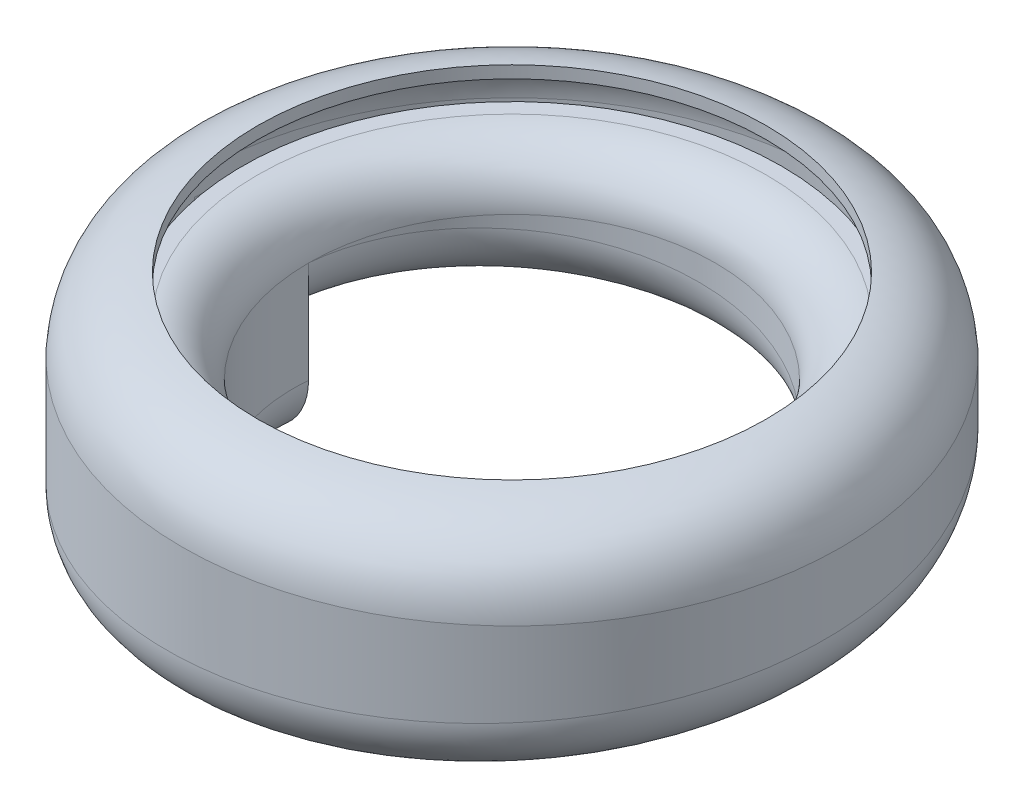
ISO-10303-21;
HEADER;
FILE_DESCRIPTION(('STEP AP214'),'2;1');
FILE_NAME('part.step','',(''),(''),'','','');
FILE_SCHEMA(('AUTOMOTIVE_DESIGN { 1 0 10303 214 1 1 1 1 }'));
ENDSEC;
DATA;
#1=APPLICATION_CONTEXT('core data for automotive mechanical design processes');
#2=APPLICATION_PROTOCOL_DEFINITION('international standard','automotive_design',2000,#1);
#3=PRODUCT_CONTEXT('',#1,'mechanical');
#4=PRODUCT('Part','Part','',(#3));
#5=PRODUCT_RELATED_PRODUCT_CATEGORY('part','',(#4));
#6=PRODUCT_DEFINITION_FORMATION('','',#4);
#7=PRODUCT_DEFINITION_CONTEXT('part definition',#1,'design');
#8=PRODUCT_DEFINITION('design','',#6,#7);
#9=PRODUCT_DEFINITION_SHAPE('','',#8);
#10=(LENGTH_UNIT() NAMED_UNIT(*) SI_UNIT(.MILLI.,.METRE.));
#11=(NAMED_UNIT(*) PLANE_ANGLE_UNIT() SI_UNIT($,.RADIAN.));
#12=(NAMED_UNIT(*) SI_UNIT($,.STERADIAN.) SOLID_ANGLE_UNIT());
#13=UNCERTAINTY_MEASURE_WITH_UNIT(LENGTH_MEASURE(1.E-05),#10,'distance_accuracy_value','');
#14=(GEOMETRIC_REPRESENTATION_CONTEXT(3) GLOBAL_UNCERTAINTY_ASSIGNED_CONTEXT((#13)) GLOBAL_UNIT_ASSIGNED_CONTEXT((#10,
#11,#12)) REPRESENTATION_CONTEXT('',''));
#15=CARTESIAN_POINT('',(0.,0.,0.));
#16=DIRECTION('',(0.,0.,1.));
#17=DIRECTION('',(1.,0.,0.));
#18=AXIS2_PLACEMENT_3D('',#15,#16,#17);
#19=CARTESIAN_POINT('',(0.,0.,0.));
#20=DIRECTION('',(0.,-1.,0.));
#21=DIRECTION('',(0.,0.,-1.));
#22=AXIS2_PLACEMENT_3D('',#19,#20,#21);
#23=TOROIDAL_SURFACE('',#22,25.,3.80000000000001);
#24=CARTESIAN_POINT('',(0.,3.8,0.));
#25=DIRECTION('',(0.,-1.,0.));
#26=DIRECTION('',(0.,0.,-1.));
#27=AXIS2_PLACEMENT_3D('',#24,#25,#26);
#28=CIRCLE('',#27,25.);
#29=CARTESIAN_POINT('',(0.,3.8,-25.));
#30=VERTEX_POINT('',#29);
#31=EDGE_CURVE('E127',#30,#30,#28,.T.);
#32=ORIENTED_EDGE('',*,*,#31,.T.);
#33=EDGE_LOOP('',(#32));
#34=FACE_BOUND('',#33,.T.);
#35=CARTESIAN_POINT('',(0.,0.,0.));
#36=DIRECTION('',(0.,-1.,0.));
#37=DIRECTION('',(0.,0.,-1.));
#38=AXIS2_PLACEMENT_3D('',#35,#36,#37);
#39=CIRCLE('',#38,21.2);
#40=CARTESIAN_POINT('',(-21.2,0.,0.));
#41=VERTEX_POINT('',#40);
#42=EDGE_CURVE('E233',#41,#41,#39,.T.);
#43=ORIENTED_EDGE('',*,*,#42,.F.);
#44=EDGE_LOOP('',(#43));
#45=FACE_BOUND('',#44,.T.);
#46=ADVANCED_FACE('F173',(#34,#45),#23,.F.);
#47=CARTESIAN_POINT('',(25.,3.8,0.));
#48=DIRECTION('',(0.,-1.,0.));
#49=DIRECTION('',(0.,0.,-1.));
#50=AXIS2_PLACEMENT_3D('',#47,#48,#49);
#51=PLANE('',#50);
#52=CARTESIAN_POINT('',(0.,3.8,0.));
#53=DIRECTION('',(0.,-1.,0.));
#54=DIRECTION('',(0.,0.,-1.));
#55=AXIS2_PLACEMENT_3D('',#52,#53,#54);
#56=CIRCLE('',#55,26.5);
#57=CARTESIAN_POINT('',(0.,3.80000000000001,-26.5));
#58=VERTEX_POINT('',#57);
#59=EDGE_CURVE('E181',#58,#58,#56,.T.);
#60=ORIENTED_EDGE('',*,*,#59,.T.);
#61=EDGE_LOOP('',(#60));
#62=FACE_BOUND('',#61,.T.);
#63=ORIENTED_EDGE('',*,*,#31,.F.);
#64=EDGE_LOOP('',(#63));
#65=FACE_BOUND('',#64,.T.);
#66=ADVANCED_FACE('F267',(#62,#65),#51,.T.);
#67=CARTESIAN_POINT('',(0.,-9.99999999999999,0.));
#68=DIRECTION('',(0.,-1.,0.));
#69=DIRECTION('',(0.,0.,-1.));
#70=AXIS2_PLACEMENT_3D('',#67,#68,#69);
#71=CYLINDRICAL_SURFACE('',#70,26.5);
#72=CARTESIAN_POINT('',(0.,5.,0.));
#73=DIRECTION('',(0.,-1.,0.));
#74=DIRECTION('',(0.,0.,-1.));
#75=AXIS2_PLACEMENT_3D('',#72,#73,#74);
#76=CIRCLE('',#75,26.5);
#77=CARTESIAN_POINT('',(0.,5.00000000000001,-26.5));
#78=VERTEX_POINT('',#77);
#79=EDGE_CURVE('E262',#78,#78,#76,.T.);
#80=ORIENTED_EDGE('',*,*,#79,.T.);
#81=EDGE_LOOP('',(#80));
#82=FACE_BOUND('',#81,.T.);
#83=ORIENTED_EDGE('',*,*,#59,.F.);
#84=EDGE_LOOP('',(#83));
#85=FACE_BOUND('',#84,.T.);
#86=ADVANCED_FACE('F270',(#82,#85),#71,.T.);
#87=CARTESIAN_POINT('',(26.5,5.00000000000001,0.));
#88=DIRECTION('',(0.,1.,0.));
#89=DIRECTION('',(0.,0.,1.));
#90=AXIS2_PLACEMENT_3D('',#87,#88,#89);
#91=PLANE('',#90);
#92=CARTESIAN_POINT('',(0.,5.00000000000001,0.));
#93=DIRECTION('',(0.,-1.,0.));
#94=DIRECTION('',(0.,0.,-1.));
#95=AXIS2_PLACEMENT_3D('',#92,#93,#94);
#96=CIRCLE('',#95,25.);
#97=CARTESIAN_POINT('',(0.,5.00000000000002,-25.));
#98=VERTEX_POINT('',#97);
#99=EDGE_CURVE('E259',#98,#98,#96,.T.);
#100=ORIENTED_EDGE('',*,*,#99,.T.);
#101=EDGE_LOOP('',(#100));
#102=FACE_BOUND('',#101,.T.);
#103=ORIENTED_EDGE('',*,*,#79,.F.);
#104=EDGE_LOOP('',(#103));
#105=FACE_BOUND('',#104,.T.);
#106=ADVANCED_FACE('F272',(#102,#105),#91,.T.);
#107=CARTESIAN_POINT('',(0.,0.,0.));
#108=DIRECTION('',(0.,-1.,0.));
#109=DIRECTION('',(0.,0.,-1.));
#110=AXIS2_PLACEMENT_3D('',#107,#108,#109);
#111=TOROIDAL_SURFACE('',#110,25.,5.00000000000001);
#112=CARTESIAN_POINT('',(0.,0.,0.));
#113=DIRECTION('',(0.,-1.,0.));
#114=DIRECTION('',(0.,0.,-1.));
#115=AXIS2_PLACEMENT_3D('',#112,#113,#114);
#116=CIRCLE('',#115,20.);
#117=CARTESIAN_POINT('',(-20.,0.,0.));
#118=VERTEX_POINT('',#117);
#119=EDGE_CURVE('E235',#118,#118,#116,.T.);
#120=ORIENTED_EDGE('',*,*,#119,.T.);
#121=EDGE_LOOP('',(#120));
#122=FACE_BOUND('',#121,.T.);
#123=ORIENTED_EDGE('',*,*,#99,.F.);
#124=EDGE_LOOP('',(#123));
#125=FACE_BOUND('',#124,.T.);
#126=ADVANCED_FACE('F279',(#122,#125),#111,.T.);
#127=CARTESIAN_POINT('',(0.,-48.4479101716472,0.));
#128=DIRECTION('',(0.,1.,0.));
#129=DIRECTION('',(0.,0.,1.));
#130=AXIS2_PLACEMENT_3D('',#127,#128,#129);
#131=CYLINDRICAL_SURFACE('',#130,21.2);
#132=CARTESIAN_POINT('',(-21.2,0.,0.));
#133=CARTESIAN_POINT('',(-21.2,-0.3125,-4.21694218844875));
#134=CARTESIAN_POINT('',(-19.5862460892393,-0.625,-8.1128887661399));
#135=CARTESIAN_POINT('',(-17.9724921784786,-0.9375,-12.0088353438311));
#136=CARTESIAN_POINT('',(-14.9906637611548,-1.25,-14.9906637611548));
#137=CARTESIAN_POINT('',(-12.0088353438311,-1.5625,-17.9724921784786));
#138=CARTESIAN_POINT('',(-8.11288876613991,-1.875,-19.5862460892393));
#139=CARTESIAN_POINT('',(-4.21694218844875,-2.1875,-21.2));
#140=CARTESIAN_POINT('',(0.,-2.5,-21.2));
#141=CARTESIAN_POINT('',(4.21694218844875,-2.8125,-21.2));
#142=CARTESIAN_POINT('',(8.1128887661399,-3.125,-19.5862460892393));
#143=CARTESIAN_POINT('',(12.0088353438311,-3.4375,-17.9724921784786));
#144=CARTESIAN_POINT('',(14.9906637611548,-3.75,-14.9906637611548));
#145=CARTESIAN_POINT('',(17.9724921784786,-4.0625,-12.0088353438311));
#146=CARTESIAN_POINT('',(19.5862460892393,-4.375,-8.11288876613991));
#147=CARTESIAN_POINT('',(21.2,-4.6875,-4.21694218844876));
#148=CARTESIAN_POINT('',(21.2,-5.,0.));
#149=CARTESIAN_POINT('',(21.2,-5.3125,4.21694218844875));
#150=CARTESIAN_POINT('',(19.5862460892393,-5.625,8.1128887661399));
#151=CARTESIAN_POINT('',(17.9724921784786,-5.9375,12.0088353438311));
#152=CARTESIAN_POINT('',(14.9906637611548,-6.25,14.9906637611548));
#153=CARTESIAN_POINT('',(12.0088353438311,-6.5625,17.9724921784786));
#154=CARTESIAN_POINT('',(8.11288876613992,-6.875,19.5862460892393));
#155=CARTESIAN_POINT('',(4.21694218844876,-7.1875,21.2));
#156=CARTESIAN_POINT('',(0.,-7.5,21.2));
#157=CARTESIAN_POINT('',(-4.21694218844875,-7.8125,21.2));
#158=CARTESIAN_POINT('',(-8.11288876613991,-8.125,19.5862460892393));
#159=CARTESIAN_POINT('',(-12.008835343831,-8.4375,17.9724921784786));
#160=CARTESIAN_POINT('',(-14.9906637611548,-8.75,14.9906637611548));
#161=CARTESIAN_POINT('',(-17.9724921784786,-9.0625,12.0088353438311));
#162=CARTESIAN_POINT('',(-19.5862460892393,-9.375,8.11288876613992));
#163=CARTESIAN_POINT('',(-21.2,-9.6875,4.21694218844876));
#164=CARTESIAN_POINT('',(-21.2,-10.,0.));
#165=(BOUNDED_CURVE() B_SPLINE_CURVE(2,(#132,#133,#134,#135,#136,#137,#138,#139,#140,#141,#142,
#143,#144,#145,#146,#147,#148,#149,#150,#151,#152,#153,#154,#155,#156,#157,#158,#159,#160,#161,
#162,#163,#164),.UNSPECIFIED.,.F.,.F.) B_SPLINE_CURVE_WITH_KNOTS((3,2,2,2,2,2,2,2,2,2,2,2,2,2,2,
2,3),(0.,0.0625,0.125,0.1875,0.25,0.3125,0.375,0.4375,0.5,0.5625,0.625,0.6875,0.75,0.8125,0.875,
0.9375,1.),.UNSPECIFIED.) CURVE() GEOMETRIC_REPRESENTATION_ITEM() RATIONAL_B_SPLINE_CURVE((1.,
0.98078528040323,1.,0.98078528040323,1.,0.98078528040323,1.,0.98078528040323,1.,
0.98078528040323,1.,0.98078528040323,1.,0.98078528040323,1.,0.98078528040323,1.,
0.98078528040323,1.,0.98078528040323,1.,0.98078528040323,1.,0.98078528040323,1.,
0.98078528040323,1.,0.98078528040323,1.,0.98078528040323,1.,0.98078528040323,1.)) REPRESENTATION_ITEM(''));
#166=CARTESIAN_POINT('',(-21.2,-10.,0.));
#167=VERTEX_POINT('',#166);
#168=EDGE_CURVE('E236',#41,#167,#165,.T.);
#169=ORIENTED_EDGE('',*,*,#168,.F.);
#170=ORIENTED_EDGE('',*,*,#42,.T.);
#171=DIRECTION('',(0.,1.,0.));
#172=VECTOR('',#171,1.);
#173=CARTESIAN_POINT('',(-21.2,-48.4479101716472,0.));
#174=LINE('',#173,#172);
#175=CARTESIAN_POINT('',(-21.2,-3.66606055596468,0.));
#176=VERTEX_POINT('',#175);
#177=EDGE_CURVE('E482',#41,#176,#174,.F.);
#178=ORIENTED_EDGE('',*,*,#177,.T.);
#179=DIRECTION('',(0.,1.,0.));
#180=VECTOR('',#179,1.);
#181=CARTESIAN_POINT('',(-21.2,-48.4479101716472,0.));
#182=LINE('',#181,#180);
#183=EDGE_CURVE('E187',#167,#176,#182,.T.);
#184=ORIENTED_EDGE('',*,*,#183,.F.);
#185=EDGE_LOOP('',(#169,#170,#178,#184));
#186=FACE_BOUND('',#185,.T.);
#187=ADVANCED_FACE('F238',(#186),#131,.T.);
#188=CARTESIAN_POINT('',(-21.2,-48.4479101716472,0.));
#189=DIRECTION('',(0.,0.,1.));
#190=DIRECTION('',(0.,-1.,0.));
#191=AXIS2_PLACEMENT_3D('',#188,#189,#190);
#192=PLANE('',#191);
#193=CARTESIAN_POINT('',(-26.2,0.,0.));
#194=DIRECTION('',(0.,0.,1.));
#195=DIRECTION('',(-1.,0.,0.));
#196=AXIS2_PLACEMENT_3D('',#193,#194,#195);
#197=CIRCLE('',#196,6.2);
#198=EDGE_CURVE('E460',#176,#118,#197,.T.);
#199=ORIENTED_EDGE('',*,*,#198,.T.);
#200=DIRECTION('',(0.,1.,0.));
#201=VECTOR('',#200,1.);
#202=CARTESIAN_POINT('',(-20.,-48.4479101716472,0.));
#203=LINE('',#202,#201);
#204=CARTESIAN_POINT('',(-20.,-10.,0.));
#205=VERTEX_POINT('',#204);
#206=EDGE_CURVE('E455',#205,#118,#203,.T.);
#207=ORIENTED_EDGE('',*,*,#206,.F.);
#208=CARTESIAN_POINT('',(-26.2,-10.,0.));
#209=DIRECTION('',(0.,0.,-1.));
#210=DIRECTION('',(-1.,0.,0.));
#211=AXIS2_PLACEMENT_3D('',#208,#209,#210);
#212=CIRCLE('',#211,6.2);
#213=CARTESIAN_POINT('',(-32.4,-10.,0.));
#214=VERTEX_POINT('',#213);
#215=EDGE_CURVE('E463',#205,#214,#212,.T.);
#216=ORIENTED_EDGE('',*,*,#215,.T.);
#217=DIRECTION('',(0.,1.,0.));
#218=VECTOR('',#217,1.);
#219=CARTESIAN_POINT('',(-32.4,-73.13549070048,0.));
#220=LINE('',#219,#218);
#221=CARTESIAN_POINT('',(-32.4,0.,0.));
#222=VERTEX_POINT('',#221);
#223=EDGE_CURVE('E531',#214,#222,#220,.T.);
#224=ORIENTED_EDGE('',*,*,#223,.T.);
#225=CARTESIAN_POINT('',(-31.2,-3.66606055596468,0.));
#226=VERTEX_POINT('',#225);
#227=EDGE_CURVE('E467',#222,#226,#197,.T.);
#228=ORIENTED_EDGE('',*,*,#227,.T.);
#229=DIRECTION('',(0.,1.,0.));
#230=VECTOR('',#229,1.);
#231=CARTESIAN_POINT('',(-31.2,-73.13549070048,0.));
#232=LINE('',#231,#230);
#233=CARTESIAN_POINT('',(-31.2,-10.,0.));
#234=VERTEX_POINT('',#233);
#235=EDGE_CURVE('E536',#234,#226,#232,.T.);
#236=ORIENTED_EDGE('',*,*,#235,.F.);
#237=CARTESIAN_POINT('',(-26.2,-10.,0.));
#238=DIRECTION('',(0.,0.,1.));
#239=DIRECTION('',(1.,0.,0.));
#240=AXIS2_PLACEMENT_3D('',#237,#238,#239);
#241=CIRCLE('',#240,5.);
#242=EDGE_CURVE('E479',#234,#167,#241,.T.);
#243=ORIENTED_EDGE('',*,*,#242,.T.);
#244=ORIENTED_EDGE('',*,*,#183,.T.);
#245=EDGE_LOOP('',(#199,#207,#216,#224,#228,#236,#243,#244));
#246=FACE_BOUND('',#245,.T.);
#247=ADVANCED_FACE('F366',(#246),#192,.F.);
#248=CARTESIAN_POINT('',(0.,-48.4479101716472,0.));
#249=DIRECTION('',(0.,1.,0.));
#250=DIRECTION('',(0.,0.,1.));
#251=AXIS2_PLACEMENT_3D('',#248,#249,#250);
#252=CYLINDRICAL_SURFACE('',#251,20.);
#253=CARTESIAN_POINT('',(-20.,0.,0.));
#254=CARTESIAN_POINT('',(-20.,-0.312500000000003,-3.97824734759316));
#255=CARTESIAN_POINT('',(-18.4775906502257,-0.625000000000003,-7.6536686473018));
#256=CARTESIAN_POINT('',(-16.9551813004515,-0.937500000000003,-11.3290899470104));
#257=CARTESIAN_POINT('',(-14.142135623731,-1.25,-14.142135623731));
#258=CARTESIAN_POINT('',(-11.3290899470104,-1.5625,-16.9551813004515));
#259=CARTESIAN_POINT('',(-7.6536686473018,-1.875,-18.4775906502257));
#260=CARTESIAN_POINT('',(-3.97824734759316,-2.1875,-20.));
#261=CARTESIAN_POINT('',(0.,-2.5,-20.));
#262=CARTESIAN_POINT('',(3.97824734759316,-2.8125,-20.));
#263=CARTESIAN_POINT('',(7.65366864730179,-3.125,-18.4775906502257));
#264=CARTESIAN_POINT('',(11.3290899470104,-3.4375,-16.9551813004515));
#265=CARTESIAN_POINT('',(14.1421356237309,-3.75,-14.142135623731));
#266=CARTESIAN_POINT('',(16.9551813004515,-4.0625,-11.3290899470104));
#267=CARTESIAN_POINT('',(18.4775906502257,-4.375,-7.6536686473018));
#268=CARTESIAN_POINT('',(20.,-4.6875,-3.97824734759317));
#269=CARTESIAN_POINT('',(20.,-5.,0.));
#270=CARTESIAN_POINT('',(20.,-5.3125,3.97824734759316));
#271=CARTESIAN_POINT('',(18.4775906502257,-5.625,7.65366864730179));
#272=CARTESIAN_POINT('',(16.9551813004515,-5.9375,11.3290899470104));
#273=CARTESIAN_POINT('',(14.142135623731,-6.25,14.1421356237309));
#274=CARTESIAN_POINT('',(11.3290899470104,-6.5625,16.9551813004515));
#275=CARTESIAN_POINT('',(7.65366864730181,-6.875,18.4775906502257));
#276=CARTESIAN_POINT('',(3.97824734759317,-7.1875,20.));
#277=CARTESIAN_POINT('',(0.,-7.5,20.));
#278=CARTESIAN_POINT('',(-3.97824734759316,-7.8125,20.));
#279=CARTESIAN_POINT('',(-7.6536686473018,-8.125,18.4775906502257));
#280=CARTESIAN_POINT('',(-11.3290899470104,-8.4375,16.9551813004515));
#281=CARTESIAN_POINT('',(-14.1421356237309,-8.75,14.142135623731));
#282=CARTESIAN_POINT('',(-16.9551813004515,-9.0625,11.3290899470104));
#283=CARTESIAN_POINT('',(-18.4775906502257,-9.375,7.65366864730181));
#284=CARTESIAN_POINT('',(-20.,-9.6875,3.97824734759317));
#285=CARTESIAN_POINT('',(-20.,-10.,0.));
#286=(BOUNDED_CURVE() B_SPLINE_CURVE(2,(#253,#254,#255,#256,#257,#258,#259,#260,#261,#262,#263,
#264,#265,#266,#267,#268,#269,#270,#271,#272,#273,#274,#275,#276,#277,#278,#279,#280,#281,#282,
#283,#284,#285),.UNSPECIFIED.,.F.,.F.) B_SPLINE_CURVE_WITH_KNOTS((3,2,2,2,2,2,2,2,2,2,2,2,2,2,2,
2,3),(0.,0.0625,0.125,0.1875,0.25,0.3125,0.375,0.4375,0.5,0.5625,0.625,0.6875,0.75,0.8125,0.875,
0.9375,1.),.UNSPECIFIED.) CURVE() GEOMETRIC_REPRESENTATION_ITEM() RATIONAL_B_SPLINE_CURVE((1.,
0.98078528040323,1.,0.98078528040323,1.,0.98078528040323,1.,0.98078528040323,1.,
0.98078528040323,1.,0.98078528040323,1.,0.98078528040323,1.,0.98078528040323,1.,
0.98078528040323,1.,0.98078528040323,1.,0.98078528040323,1.,0.98078528040323,1.,
0.98078528040323,1.,0.98078528040323,1.,0.98078528040323,1.,0.98078528040323,1.)) REPRESENTATION_ITEM(''));
#287=EDGE_CURVE('E243',#205,#118,#286,.F.);
#288=ORIENTED_EDGE('',*,*,#287,.F.);
#289=ORIENTED_EDGE('',*,*,#206,.T.);
#290=ORIENTED_EDGE('',*,*,#119,.F.);
#291=EDGE_LOOP('',(#288,#289,#290));
#292=FACE_BOUND('',#291,.T.);
#293=ADVANCED_FACE('F371',(#292),#252,.F.);
#294=CARTESIAN_POINT('',(-26.2,-5.,0.));
#295=DIRECTION('',(0.,0.,1.));
#296=DIRECTION('',(1.,0.,0.));
#297=AXIS2_PLACEMENT_3D('',#294,#295,#296);
#298=PLANE('',#297);
#299=ORIENTED_EDGE('',*,*,#177,.F.);
#300=CARTESIAN_POINT('',(-26.2,0.,0.));
#301=DIRECTION('',(0.,0.,-1.));
#302=DIRECTION('',(1.,0.,0.));
#303=AXIS2_PLACEMENT_3D('',#300,#301,#302);
#304=CIRCLE('',#303,5.);
#305=CARTESIAN_POINT('',(-31.2,0.,0.));
#306=VERTEX_POINT('',#305);
#307=EDGE_CURVE('E476',#41,#306,#304,.T.);
#308=ORIENTED_EDGE('',*,*,#307,.T.);
#309=EDGE_CURVE('E537',#226,#306,#232,.T.);
#310=ORIENTED_EDGE('',*,*,#309,.F.);
#311=EDGE_CURVE('E464',#226,#176,#197,.T.);
#312=ORIENTED_EDGE('',*,*,#311,.T.);
#313=EDGE_LOOP('',(#299,#308,#310,#312));
#314=FACE_BOUND('',#313,.T.);
#315=ADVANCED_FACE('F398',(#314),#298,.T.);
#316=CARTESIAN_POINT('',(-21.2,0.,0.));
#317=CARTESIAN_POINT('',(-21.2,-0.3125,-4.21694218844875));
#318=CARTESIAN_POINT('',(-19.5862460892393,-0.625,-8.1128887661399));
#319=CARTESIAN_POINT('',(-17.9724921784786,-0.9375,-12.0088353438311));
#320=CARTESIAN_POINT('',(-14.9906637611548,-1.25,-14.9906637611548));
#321=CARTESIAN_POINT('',(-12.0088353438311,-1.5625,-17.9724921784786));
#322=CARTESIAN_POINT('',(-8.11288876613991,-1.875,-19.5862460892393));
#323=CARTESIAN_POINT('',(-4.21694218844875,-2.1875,-21.2));
#324=CARTESIAN_POINT('',(0.,-2.5,-21.2));
#325=CARTESIAN_POINT('',(4.21694218844875,-2.8125,-21.2));
#326=CARTESIAN_POINT('',(8.1128887661399,-3.125,-19.5862460892393));
#327=CARTESIAN_POINT('',(12.0088353438311,-3.4375,-17.9724921784786));
#328=CARTESIAN_POINT('',(14.9906637611548,-3.75,-14.9906637611548));
#329=CARTESIAN_POINT('',(17.9724921784786,-4.0625,-12.0088353438311));
#330=CARTESIAN_POINT('',(19.5862460892393,-4.375,-8.11288876613991));
#331=CARTESIAN_POINT('',(21.2,-4.6875,-4.21694218844876));
#332=CARTESIAN_POINT('',(21.2,-5.,0.));
#333=CARTESIAN_POINT('',(21.2,-5.3125,4.21694218844875));
#334=CARTESIAN_POINT('',(19.5862460892393,-5.625,8.1128887661399));
#335=CARTESIAN_POINT('',(17.9724921784786,-5.9375,12.0088353438311));
#336=CARTESIAN_POINT('',(14.9906637611548,-6.25,14.9906637611548));
#337=CARTESIAN_POINT('',(12.0088353438311,-6.5625,17.9724921784786));
#338=CARTESIAN_POINT('',(8.11288876613992,-6.875,19.5862460892393));
#339=CARTESIAN_POINT('',(4.21694218844876,-7.1875,21.2));
#340=CARTESIAN_POINT('',(0.,-7.5,21.2));
#341=CARTESIAN_POINT('',(-4.21694218844875,-7.8125,21.2));
#342=CARTESIAN_POINT('',(-8.11288876613991,-8.125,19.5862460892393));
#343=CARTESIAN_POINT('',(-12.008835343831,-8.4375,17.9724921784786));
#344=CARTESIAN_POINT('',(-14.9906637611548,-8.75,14.9906637611548));
#345=CARTESIAN_POINT('',(-17.9724921784786,-9.0625,12.0088353438311));
#346=CARTESIAN_POINT('',(-19.5862460892393,-9.375,8.11288876613992));
#347=CARTESIAN_POINT('',(-21.2,-9.6875,4.21694218844876));
#348=CARTESIAN_POINT('',(-21.2,-10.,0.));
#349=CARTESIAN_POINT('',(-21.2,-10.,0.));
#350=CARTESIAN_POINT('',(-21.2,-10.3125,-4.21694218844875));
#351=CARTESIAN_POINT('',(-19.5862460892393,-10.625,-8.1128887661399));
#352=CARTESIAN_POINT('',(-17.9724921784786,-10.9375,-12.0088353438311));
#353=CARTESIAN_POINT('',(-14.9906637611548,-11.25,-14.9906637611548));
#354=CARTESIAN_POINT('',(-12.0088353438311,-11.5625,-17.9724921784786));
#355=CARTESIAN_POINT('',(-8.11288876613991,-11.875,-19.5862460892393));
#356=CARTESIAN_POINT('',(-4.21694218844875,-12.1875,-21.2));
#357=CARTESIAN_POINT('',(0.,-12.5,-21.2));
#358=CARTESIAN_POINT('',(4.21694218844875,-12.8125,-21.2));
#359=CARTESIAN_POINT('',(8.1128887661399,-13.125,-19.5862460892393));
#360=CARTESIAN_POINT('',(12.0088353438311,-13.4375,-17.9724921784786));
#361=CARTESIAN_POINT('',(14.9906637611548,-13.75,-14.9906637611548));
#362=CARTESIAN_POINT('',(17.9724921784786,-14.0625,-12.0088353438311));
#363=CARTESIAN_POINT('',(19.5862460892393,-14.375,-8.11288876613991));
#364=CARTESIAN_POINT('',(21.2,-14.6875,-4.21694218844876));
#365=CARTESIAN_POINT('',(21.2,-15.,0.));
#366=CARTESIAN_POINT('',(21.2,-15.3125,4.21694218844875));
#367=CARTESIAN_POINT('',(19.5862460892393,-15.625,8.1128887661399));
#368=CARTESIAN_POINT('',(17.9724921784786,-15.9375,12.0088353438311));
#369=CARTESIAN_POINT('',(14.9906637611548,-16.25,14.9906637611548));
#370=CARTESIAN_POINT('',(12.0088353438311,-16.5625,17.9724921784786));
#371=CARTESIAN_POINT('',(8.11288876613992,-16.875,19.5862460892393));
#372=CARTESIAN_POINT('',(4.21694218844876,-17.1875,21.2));
#373=CARTESIAN_POINT('',(0.,-17.5,21.2));
#374=CARTESIAN_POINT('',(-4.21694218844875,-17.8125,21.2));
#375=CARTESIAN_POINT('',(-8.11288876613991,-18.125,19.5862460892393));
#376=CARTESIAN_POINT('',(-12.008835343831,-18.4375,17.9724921784786));
#377=CARTESIAN_POINT('',(-14.9906637611548,-18.75,14.9906637611548));
#378=CARTESIAN_POINT('',(-17.9724921784786,-19.0625,12.0088353438311));
#379=CARTESIAN_POINT('',(-19.5862460892393,-19.375,8.11288876613992));
#380=CARTESIAN_POINT('',(-21.2,-19.6875,4.21694218844876));
#381=CARTESIAN_POINT('',(-21.2,-20.,0.));
#382=CARTESIAN_POINT('',(-31.2,-10.,0.));
#383=CARTESIAN_POINT('',(-31.2,-10.3125,-6.20606586224533));
#384=CARTESIAN_POINT('',(-28.8250414143521,-10.625,-11.9397230897908));
#385=CARTESIAN_POINT('',(-26.4500828287043,-10.9375,-17.6733803173363));
#386=CARTESIAN_POINT('',(-22.0617315730203,-11.25,-22.0617315730203));
#387=CARTESIAN_POINT('',(-17.6733803173363,-11.5625,-26.4500828287043));
#388=CARTESIAN_POINT('',(-11.9397230897908,-11.875,-28.8250414143521));
#389=CARTESIAN_POINT('',(-6.20606586224533,-12.1875,-31.2));
#390=CARTESIAN_POINT('',(0.,-12.5,-31.2));
#391=CARTESIAN_POINT('',(6.20606586224533,-12.8125,-31.2));
#392=CARTESIAN_POINT('',(11.9397230897908,-13.125,-28.8250414143521));
#393=CARTESIAN_POINT('',(17.6733803173363,-13.4375,-26.4500828287043));
#394=CARTESIAN_POINT('',(22.0617315730203,-13.75,-22.0617315730203));
#395=CARTESIAN_POINT('',(26.4500828287043,-14.0625,-17.6733803173363));
#396=CARTESIAN_POINT('',(28.8250414143521,-14.375,-11.9397230897908));
#397=CARTESIAN_POINT('',(31.2,-14.6875,-6.20606586224534));
#398=CARTESIAN_POINT('',(31.2,-15.,0.));
#399=CARTESIAN_POINT('',(31.2,-15.3125,6.20606586224533));
#400=CARTESIAN_POINT('',(28.8250414143522,-15.625,11.9397230897908));
#401=CARTESIAN_POINT('',(26.4500828287043,-15.9375,17.6733803173363));
#402=CARTESIAN_POINT('',(22.0617315730203,-16.25,22.0617315730203));
#403=CARTESIAN_POINT('',(17.6733803173363,-16.5625,26.4500828287043));
#404=CARTESIAN_POINT('',(11.9397230897908,-16.875,28.8250414143521));
#405=CARTESIAN_POINT('',(6.20606586224534,-17.1875,31.2));
#406=CARTESIAN_POINT('',(0.,-17.5,31.2));
#407=CARTESIAN_POINT('',(-6.20606586224533,-17.8125,31.2));
#408=CARTESIAN_POINT('',(-11.9397230897908,-18.125,28.8250414143521));
#409=CARTESIAN_POINT('',(-17.6733803173363,-18.4375,26.4500828287043));
#410=CARTESIAN_POINT('',(-22.0617315730203,-18.75,22.0617315730203));
#411=CARTESIAN_POINT('',(-26.4500828287043,-19.0625,17.6733803173363));
#412=CARTESIAN_POINT('',(-28.8250414143521,-19.375,11.9397230897908));
#413=CARTESIAN_POINT('',(-31.2,-19.6875,6.20606586224535));
#414=CARTESIAN_POINT('',(-31.2,-20.,0.));
#415=CARTESIAN_POINT('',(-31.2,0.,0.));
#416=CARTESIAN_POINT('',(-31.2,-0.312500000000001,-6.20606586224533));
#417=CARTESIAN_POINT('',(-28.8250414143521,-0.625000000000001,-11.9397230897908));
#418=CARTESIAN_POINT('',(-26.4500828287043,-0.937500000000001,-17.6733803173363));
#419=CARTESIAN_POINT('',(-22.0617315730203,-1.25,-22.0617315730203));
#420=CARTESIAN_POINT('',(-17.6733803173363,-1.5625,-26.4500828287043));
#421=CARTESIAN_POINT('',(-11.9397230897908,-1.875,-28.8250414143521));
#422=CARTESIAN_POINT('',(-6.20606586224533,-2.1875,-31.2));
#423=CARTESIAN_POINT('',(0.,-2.5,-31.2));
#424=CARTESIAN_POINT('',(6.20606586224533,-2.8125,-31.2));
#425=CARTESIAN_POINT('',(11.9397230897908,-3.125,-28.8250414143521));
#426=CARTESIAN_POINT('',(17.6733803173363,-3.4375,-26.4500828287043));
#427=CARTESIAN_POINT('',(22.0617315730203,-3.75,-22.0617315730203));
#428=CARTESIAN_POINT('',(26.4500828287043,-4.0625,-17.6733803173363));
#429=CARTESIAN_POINT('',(28.8250414143521,-4.375,-11.9397230897908));
#430=CARTESIAN_POINT('',(31.2,-4.6875,-6.20606586224534));
#431=CARTESIAN_POINT('',(31.2,-5.,0.));
#432=CARTESIAN_POINT('',(31.2,-5.3125,6.20606586224533));
#433=CARTESIAN_POINT('',(28.8250414143522,-5.625,11.9397230897908));
#434=CARTESIAN_POINT('',(26.4500828287043,-5.9375,17.6733803173363));
#435=CARTESIAN_POINT('',(22.0617315730203,-6.25,22.0617315730203));
#436=CARTESIAN_POINT('',(17.6733803173363,-6.5625,26.4500828287043));
#437=CARTESIAN_POINT('',(11.9397230897908,-6.875,28.8250414143521));
#438=CARTESIAN_POINT('',(6.20606586224534,-7.1875,31.2));
#439=CARTESIAN_POINT('',(0.,-7.5,31.2));
#440=CARTESIAN_POINT('',(-6.20606586224533,-7.8125,31.2));
#441=CARTESIAN_POINT('',(-11.9397230897908,-8.125,28.8250414143521));
#442=CARTESIAN_POINT('',(-17.6733803173363,-8.4375,26.4500828287043));
#443=CARTESIAN_POINT('',(-22.0617315730203,-8.75,22.0617315730203));
#444=CARTESIAN_POINT('',(-26.4500828287043,-9.0625,17.6733803173363));
#445=CARTESIAN_POINT('',(-28.8250414143521,-9.375,11.9397230897908));
#446=CARTESIAN_POINT('',(-31.2,-9.6875,6.20606586224535));
#447=CARTESIAN_POINT('',(-31.2,-10.,0.));
#448=(BOUNDED_SURFACE() B_SPLINE_SURFACE(3,2,((#316,#317,#318,#319,#320,#321,#322,#323,#324,
#325,#326,#327,#328,#329,#330,#331,#332,#333,#334,#335,#336,#337,#338,#339,#340,#341,#342,#343,
#344,#345,#346,#347,#348),(#349,#350,#351,#352,#353,#354,#355,#356,#357,#358,#359,#360,#361,
#362,#363,#364,#365,#366,#367,#368,#369,#370,#371,#372,#373,#374,#375,#376,#377,#378,#379,#380,
#381),(#382,#383,#384,#385,#386,#387,#388,#389,#390,#391,#392,#393,#394,#395,#396,#397,#398,
#399,#400,#401,#402,#403,#404,#405,#406,#407,#408,#409,#410,#411,#412,#413,#414),(#415,#416,
#417,#418,#419,#420,#421,#422,#423,#424,#425,#426,#427,#428,#429,#430,#431,#432,#433,#434,#435,
#436,#437,#438,#439,#440,#441,#442,#443,#444,#445,#446,#447)),.UNSPECIFIED.,.F.,.F.,
.F.) B_SPLINE_SURFACE_WITH_KNOTS((4,4),(3,2,2,2,2,2,2,2,2,2,2,2,2,2,2,2,3),(0.,1.),(0.,0.0625,
0.125,0.1875,0.25,0.3125,0.375,0.4375,0.5,0.5625,0.625,0.6875,0.75,0.8125,0.875,0.9375,1.),
.UNSPECIFIED.) GEOMETRIC_REPRESENTATION_ITEM() RATIONAL_B_SPLINE_SURFACE(((1.,0.98078528040323,
1.,0.98078528040323,1.,0.98078528040323,1.,0.98078528040323,1.,0.98078528040323,1.,
0.98078528040323,1.,0.98078528040323,1.,0.98078528040323,1.,0.98078528040323,1.,
0.98078528040323,1.,0.98078528040323,1.,0.98078528040323,1.,0.98078528040323,1.,
0.98078528040323,1.,0.98078528040323,1.,0.98078528040323,1.),(0.333333333333333,
0.326928426801077,0.333333333333333,0.326928426801077,0.333333333333333,0.326928426801077,
0.333333333333333,0.326928426801077,0.333333333333333,0.326928426801077,0.333333333333333,
0.326928426801077,0.333333333333333,0.326928426801077,0.333333333333333,0.326928426801077,
0.333333333333333,0.326928426801077,0.333333333333333,0.326928426801077,0.333333333333333,
0.326928426801077,0.333333333333333,0.326928426801077,0.333333333333333,0.326928426801077,
0.333333333333333,0.326928426801077,0.333333333333333,0.326928426801077,0.333333333333333,
0.326928426801077,0.333333333333333),(0.333333333333333,0.326928426801077,0.333333333333333,
0.326928426801077,0.333333333333333,0.326928426801077,0.333333333333333,0.326928426801077,
0.333333333333333,0.326928426801077,0.333333333333333,0.326928426801077,0.333333333333333,
0.326928426801077,0.333333333333333,0.326928426801077,0.333333333333333,0.326928426801077,
0.333333333333333,0.326928426801077,0.333333333333333,0.326928426801077,0.333333333333333,
0.326928426801077,0.333333333333333,0.326928426801077,0.333333333333333,0.326928426801077,
0.333333333333333,0.326928426801077,0.333333333333333,0.326928426801077,0.333333333333333),(1.,
0.98078528040323,1.,0.98078528040323,1.,0.98078528040323,1.,0.98078528040323,1.,
0.98078528040323,1.,0.98078528040323,1.,0.98078528040323,1.,0.98078528040323,1.,
0.98078528040323,1.,0.98078528040323,1.,0.98078528040323,1.,0.98078528040323,1.,
0.98078528040323,1.,0.98078528040323,1.,0.98078528040323,1.,0.98078528040323,1.))) REPRESENTATION_ITEM('') SURFACE());
#449=CARTESIAN_POINT('',(-31.2,0.,0.));
#450=CARTESIAN_POINT('',(-31.2,-0.312500000000001,-6.20606586224533));
#451=CARTESIAN_POINT('',(-28.8250414143521,-0.625000000000001,-11.9397230897908));
#452=CARTESIAN_POINT('',(-26.4500828287043,-0.937500000000001,-17.6733803173363));
#453=CARTESIAN_POINT('',(-22.0617315730203,-1.25,-22.0617315730203));
#454=CARTESIAN_POINT('',(-17.6733803173363,-1.5625,-26.4500828287043));
#455=CARTESIAN_POINT('',(-11.9397230897908,-1.875,-28.8250414143521));
#456=CARTESIAN_POINT('',(-6.20606586224533,-2.1875,-31.2));
#457=CARTESIAN_POINT('',(0.,-2.5,-31.2));
#458=CARTESIAN_POINT('',(6.20606586224533,-2.8125,-31.2));
#459=CARTESIAN_POINT('',(11.9397230897908,-3.125,-28.8250414143521));
#460=CARTESIAN_POINT('',(17.6733803173363,-3.4375,-26.4500828287043));
#461=CARTESIAN_POINT('',(22.0617315730203,-3.75,-22.0617315730203));
#462=CARTESIAN_POINT('',(26.4500828287043,-4.0625,-17.6733803173363));
#463=CARTESIAN_POINT('',(28.8250414143521,-4.375,-11.9397230897908));
#464=CARTESIAN_POINT('',(31.2,-4.6875,-6.20606586224534));
#465=CARTESIAN_POINT('',(31.2,-5.,0.));
#466=CARTESIAN_POINT('',(31.2,-5.3125,6.20606586224533));
#467=CARTESIAN_POINT('',(28.8250414143522,-5.625,11.9397230897908));
#468=CARTESIAN_POINT('',(26.4500828287043,-5.9375,17.6733803173363));
#469=CARTESIAN_POINT('',(22.0617315730203,-6.25,22.0617315730203));
#470=CARTESIAN_POINT('',(17.6733803173363,-6.5625,26.4500828287043));
#471=CARTESIAN_POINT('',(11.9397230897908,-6.875,28.8250414143521));
#472=CARTESIAN_POINT('',(6.20606586224534,-7.1875,31.2));
#473=CARTESIAN_POINT('',(0.,-7.5,31.2));
#474=CARTESIAN_POINT('',(-6.20606586224533,-7.8125,31.2));
#475=CARTESIAN_POINT('',(-11.9397230897908,-8.125,28.8250414143521));
#476=CARTESIAN_POINT('',(-17.6733803173363,-8.4375,26.4500828287043));
#477=CARTESIAN_POINT('',(-22.0617315730203,-8.75,22.0617315730203));
#478=CARTESIAN_POINT('',(-26.4500828287043,-9.0625,17.6733803173363));
#479=CARTESIAN_POINT('',(-28.8250414143521,-9.375,11.9397230897908));
#480=CARTESIAN_POINT('',(-31.2,-9.6875,6.20606586224535));
#481=CARTESIAN_POINT('',(-31.2,-10.,0.));
#482=(BOUNDED_CURVE() B_SPLINE_CURVE(2,(#449,#450,#451,#452,#453,#454,#455,#456,#457,#458,#459,
#460,#461,#462,#463,#464,#465,#466,#467,#468,#469,#470,#471,#472,#473,#474,#475,#476,#477,#478,
#479,#480,#481),.UNSPECIFIED.,.F.,.F.) B_SPLINE_CURVE_WITH_KNOTS((3,2,2,2,2,2,2,2,2,2,2,2,2,2,2,
2,3),(0.,0.0625,0.125,0.1875,0.25,0.3125,0.375,0.4375,0.5,0.5625,0.625,0.6875,0.75,0.8125,0.875,
0.9375,1.),.UNSPECIFIED.) CURVE() GEOMETRIC_REPRESENTATION_ITEM() RATIONAL_B_SPLINE_CURVE((1.,
0.98078528040323,1.,0.98078528040323,1.,0.98078528040323,1.,0.98078528040323,1.,
0.98078528040323,1.,0.98078528040323,1.,0.98078528040323,1.,0.98078528040323,1.,
0.98078528040323,1.,0.98078528040323,1.,0.98078528040323,1.,0.98078528040323,1.,
0.98078528040323,1.,0.98078528040323,1.,0.98078528040323,1.,0.98078528040323,1.)) REPRESENTATION_ITEM(''));
#483=EDGE_CURVE('E465',#306,#234,#482,.T.);
#484=ORIENTED_EDGE('',*,*,#307,.F.);
#485=ORIENTED_EDGE('',*,*,#168,.T.);
#486=ORIENTED_EDGE('',*,*,#242,.F.);
#487=ORIENTED_EDGE('',*,*,#483,.F.);
#488=EDGE_LOOP('',(#484,#485,#486,#487));
#489=FACE_BOUND('',#488,.T.);
#490=ADVANCED_FACE('F409',(#489),#448,.F.);
#491=CARTESIAN_POINT('',(-32.4,0.,0.));
#492=CARTESIAN_POINT('',(-32.4,-0.312499999999999,-6.44476070310092));
#493=CARTESIAN_POINT('',(-29.9336968533657,-0.624999999999999,-12.3989432086289));
#494=CARTESIAN_POINT('',(-27.4673937067314,-0.937499999999999,-18.3531257141569));
#495=CARTESIAN_POINT('',(-22.9102597104441,-1.25,-22.9102597104441));
#496=CARTESIAN_POINT('',(-18.3531257141569,-1.5625,-27.4673937067314));
#497=CARTESIAN_POINT('',(-12.3989432086289,-1.875,-29.9336968533657));
#498=CARTESIAN_POINT('',(-6.44476070310092,-2.1875,-32.4));
#499=CARTESIAN_POINT('',(0.,-2.5,-32.4));
#500=CARTESIAN_POINT('',(6.44476070310092,-2.8125,-32.4));
#501=CARTESIAN_POINT('',(12.3989432086289,-3.125,-29.9336968533657));
#502=CARTESIAN_POINT('',(18.3531257141569,-3.4375,-27.4673937067314));
#503=CARTESIAN_POINT('',(22.9102597104441,-3.75,-22.9102597104441));
#504=CARTESIAN_POINT('',(27.4673937067314,-4.0625,-18.3531257141569));
#505=CARTESIAN_POINT('',(29.9336968533657,-4.375,-12.3989432086289));
#506=CARTESIAN_POINT('',(32.4,-4.6875,-6.44476070310093));
#507=CARTESIAN_POINT('',(32.4,-5.,0.));
#508=CARTESIAN_POINT('',(32.4,-5.3125,6.44476070310092));
#509=CARTESIAN_POINT('',(29.9336968533657,-5.625,12.3989432086289));
#510=CARTESIAN_POINT('',(27.4673937067314,-5.9375,18.3531257141569));
#511=CARTESIAN_POINT('',(22.9102597104442,-6.25,22.9102597104441));
#512=CARTESIAN_POINT('',(18.3531257141569,-6.5625,27.4673937067314));
#513=CARTESIAN_POINT('',(12.3989432086289,-6.875,29.9336968533657));
#514=CARTESIAN_POINT('',(6.44476070310093,-7.1875,32.4));
#515=CARTESIAN_POINT('',(0.,-7.5,32.4));
#516=CARTESIAN_POINT('',(-6.44476070310092,-7.8125,32.4));
#517=CARTESIAN_POINT('',(-12.3989432086289,-8.125,29.9336968533657));
#518=CARTESIAN_POINT('',(-18.3531257141569,-8.4375,27.4673937067314));
#519=CARTESIAN_POINT('',(-22.9102597104441,-8.75,22.9102597104442));
#520=CARTESIAN_POINT('',(-27.4673937067314,-9.0625,18.3531257141569));
#521=CARTESIAN_POINT('',(-29.9336968533657,-9.375,12.3989432086289));
#522=CARTESIAN_POINT('',(-32.4,-9.6875,6.44476070310094));
#523=CARTESIAN_POINT('',(-32.4,-10.,0.));
#524=CARTESIAN_POINT('',(-32.4,-12.4,0.));
#525=CARTESIAN_POINT('',(-32.4,-12.7125,-6.44476070310092));
#526=CARTESIAN_POINT('',(-29.9336968533657,-13.025,-12.3989432086289));
#527=CARTESIAN_POINT('',(-27.4673937067314,-13.3375,-18.3531257141569));
#528=CARTESIAN_POINT('',(-22.9102597104441,-13.65,-22.9102597104441));
#529=CARTESIAN_POINT('',(-18.3531257141569,-13.9625,-27.4673937067314));
#530=CARTESIAN_POINT('',(-12.3989432086289,-14.275,-29.9336968533657));
#531=CARTESIAN_POINT('',(-6.44476070310092,-14.5875,-32.4));
#532=CARTESIAN_POINT('',(0.,-14.9,-32.4));
#533=CARTESIAN_POINT('',(6.44476070310092,-15.2125,-32.4));
#534=CARTESIAN_POINT('',(12.3989432086289,-15.525,-29.9336968533657));
#535=CARTESIAN_POINT('',(18.3531257141569,-15.8375,-27.4673937067314));
#536=CARTESIAN_POINT('',(22.9102597104441,-16.15,-22.9102597104441));
#537=CARTESIAN_POINT('',(27.4673937067314,-16.4625,-18.3531257141569));
#538=CARTESIAN_POINT('',(29.9336968533657,-16.775,-12.3989432086289));
#539=CARTESIAN_POINT('',(32.4,-17.0875,-6.44476070310093));
#540=CARTESIAN_POINT('',(32.4,-17.4,0.));
#541=CARTESIAN_POINT('',(32.4,-17.7125,6.44476070310092));
#542=CARTESIAN_POINT('',(29.9336968533657,-18.025,12.3989432086289));
#543=CARTESIAN_POINT('',(27.4673937067314,-18.3375,18.3531257141569));
#544=CARTESIAN_POINT('',(22.9102597104442,-18.65,22.9102597104441));
#545=CARTESIAN_POINT('',(18.3531257141569,-18.9625,27.4673937067314));
#546=CARTESIAN_POINT('',(12.3989432086289,-19.275,29.9336968533657));
#547=CARTESIAN_POINT('',(6.44476070310093,-19.5875,32.4));
#548=CARTESIAN_POINT('',(0.,-19.9,32.4));
#549=CARTESIAN_POINT('',(-6.44476070310092,-20.2125,32.4));
#550=CARTESIAN_POINT('',(-12.3989432086289,-20.525,29.9336968533657));
#551=CARTESIAN_POINT('',(-18.3531257141569,-20.8375,27.4673937067314));
#552=CARTESIAN_POINT('',(-22.9102597104441,-21.15,22.9102597104442));
#553=CARTESIAN_POINT('',(-27.4673937067314,-21.4625,18.3531257141569));
#554=CARTESIAN_POINT('',(-29.9336968533657,-21.775,12.3989432086289));
#555=CARTESIAN_POINT('',(-32.4,-22.0875,6.44476070310094));
#556=CARTESIAN_POINT('',(-32.4,-22.4,0.));
#557=CARTESIAN_POINT('',(-20.,-12.4,0.));
#558=CARTESIAN_POINT('',(-20.,-12.7125,-3.97824734759316));
#559=CARTESIAN_POINT('',(-18.4775906502257,-13.025,-7.65366864730179));
#560=CARTESIAN_POINT('',(-16.9551813004515,-13.3375,-11.3290899470104));
#561=CARTESIAN_POINT('',(-14.1421356237309,-13.65,-14.1421356237309));
#562=CARTESIAN_POINT('',(-11.3290899470104,-13.9625,-16.9551813004515));
#563=CARTESIAN_POINT('',(-7.65366864730179,-14.275,-18.4775906502257));
#564=CARTESIAN_POINT('',(-3.97824734759316,-14.5875,-20.));
#565=CARTESIAN_POINT('',(0.,-14.9,-20.));
#566=CARTESIAN_POINT('',(3.97824734759316,-15.2125,-20.));
#567=CARTESIAN_POINT('',(7.65366864730179,-15.525,-18.4775906502257));
#568=CARTESIAN_POINT('',(11.3290899470104,-15.8375,-16.9551813004515));
#569=CARTESIAN_POINT('',(14.1421356237309,-16.15,-14.1421356237309));
#570=CARTESIAN_POINT('',(16.9551813004515,-16.4625,-11.3290899470104));
#571=CARTESIAN_POINT('',(18.4775906502257,-16.775,-7.6536686473018));
#572=CARTESIAN_POINT('',(20.,-17.0875,-3.97824734759317));
#573=CARTESIAN_POINT('',(20.,-17.4,0.));
#574=CARTESIAN_POINT('',(20.,-17.7125,3.97824734759316));
#575=CARTESIAN_POINT('',(18.4775906502257,-18.025,7.65366864730179));
#576=CARTESIAN_POINT('',(16.9551813004515,-18.3375,11.3290899470104));
#577=CARTESIAN_POINT('',(14.142135623731,-18.65,14.1421356237309));
#578=CARTESIAN_POINT('',(11.3290899470104,-18.9625,16.9551813004515));
#579=CARTESIAN_POINT('',(7.65366864730181,-19.275,18.4775906502257));
#580=CARTESIAN_POINT('',(3.97824734759317,-19.5875,20.));
#581=CARTESIAN_POINT('',(0.,-19.9,20.));
#582=CARTESIAN_POINT('',(-3.97824734759316,-20.2125,20.));
#583=CARTESIAN_POINT('',(-7.6536686473018,-20.525,18.4775906502257));
#584=CARTESIAN_POINT('',(-11.3290899470104,-20.8375,16.9551813004515));
#585=CARTESIAN_POINT('',(-14.1421356237309,-21.15,14.142135623731));
#586=CARTESIAN_POINT('',(-16.9551813004515,-21.4625,11.3290899470104));
#587=CARTESIAN_POINT('',(-18.4775906502257,-21.775,7.65366864730181));
#588=CARTESIAN_POINT('',(-20.,-22.0875,3.97824734759317));
#589=CARTESIAN_POINT('',(-20.,-22.4,0.));
#590=CARTESIAN_POINT('',(-20.,0.,0.));
#591=CARTESIAN_POINT('',(-20.,-0.3125,-3.97824734759316));
#592=CARTESIAN_POINT('',(-18.4775906502257,-0.625,-7.65366864730179));
#593=CARTESIAN_POINT('',(-16.9551813004515,-0.9375,-11.3290899470104));
#594=CARTESIAN_POINT('',(-14.1421356237309,-1.25,-14.1421356237309));
#595=CARTESIAN_POINT('',(-11.3290899470104,-1.5625,-16.9551813004515));
#596=CARTESIAN_POINT('',(-7.65366864730179,-1.875,-18.4775906502257));
#597=CARTESIAN_POINT('',(-3.97824734759316,-2.1875,-20.));
#598=CARTESIAN_POINT('',(0.,-2.5,-20.));
#599=CARTESIAN_POINT('',(3.97824734759316,-2.8125,-20.));
#600=CARTESIAN_POINT('',(7.65366864730179,-3.125,-18.4775906502257));
#601=CARTESIAN_POINT('',(11.3290899470104,-3.4375,-16.9551813004515));
#602=CARTESIAN_POINT('',(14.1421356237309,-3.75,-14.1421356237309));
#603=CARTESIAN_POINT('',(16.9551813004515,-4.0625,-11.3290899470104));
#604=CARTESIAN_POINT('',(18.4775906502257,-4.375,-7.6536686473018));
#605=CARTESIAN_POINT('',(20.,-4.6875,-3.97824734759317));
#606=CARTESIAN_POINT('',(20.,-5.,0.));
#607=CARTESIAN_POINT('',(20.,-5.3125,3.97824734759316));
#608=CARTESIAN_POINT('',(18.4775906502257,-5.625,7.65366864730179));
#609=CARTESIAN_POINT('',(16.9551813004515,-5.9375,11.3290899470104));
#610=CARTESIAN_POINT('',(14.142135623731,-6.25,14.1421356237309));
#611=CARTESIAN_POINT('',(11.3290899470104,-6.5625,16.9551813004515));
#612=CARTESIAN_POINT('',(7.65366864730181,-6.875,18.4775906502257));
#613=CARTESIAN_POINT('',(3.97824734759317,-7.1875,20.));
#614=CARTESIAN_POINT('',(0.,-7.5,20.));
#615=CARTESIAN_POINT('',(-3.97824734759316,-7.8125,20.));
#616=CARTESIAN_POINT('',(-7.6536686473018,-8.125,18.4775906502257));
#617=CARTESIAN_POINT('',(-11.3290899470104,-8.4375,16.9551813004515));
#618=CARTESIAN_POINT('',(-14.1421356237309,-8.75,14.142135623731));
#619=CARTESIAN_POINT('',(-16.9551813004515,-9.0625,11.3290899470104));
#620=CARTESIAN_POINT('',(-18.4775906502257,-9.375,7.65366864730181));
#621=CARTESIAN_POINT('',(-20.,-9.6875,3.97824734759317));
#622=CARTESIAN_POINT('',(-20.,-10.,0.));
#623=(BOUNDED_SURFACE() B_SPLINE_SURFACE(3,2,((#491,#492,#493,#494,#495,#496,#497,#498,#499,
#500,#501,#502,#503,#504,#505,#506,#507,#508,#509,#510,#511,#512,#513,#514,#515,#516,#517,#518,
#519,#520,#521,#522,#523),(#524,#525,#526,#527,#528,#529,#530,#531,#532,#533,#534,#535,#536,
#537,#538,#539,#540,#541,#542,#543,#544,#545,#546,#547,#548,#549,#550,#551,#552,#553,#554,#555,
#556),(#557,#558,#559,#560,#561,#562,#563,#564,#565,#566,#567,#568,#569,#570,#571,#572,#573,
#574,#575,#576,#577,#578,#579,#580,#581,#582,#583,#584,#585,#586,#587,#588,#589),(#590,#591,
#592,#593,#594,#595,#596,#597,#598,#599,#600,#601,#602,#603,#604,#605,#606,#607,#608,#609,#610,
#611,#612,#613,#614,#615,#616,#617,#618,#619,#620,#621,#622)),.UNSPECIFIED.,.F.,.F.,
.F.) B_SPLINE_SURFACE_WITH_KNOTS((4,4),(3,2,2,2,2,2,2,2,2,2,2,2,2,2,2,2,3),(0.,1.),(0.,0.0625,
0.125,0.1875,0.25,0.3125,0.375,0.4375,0.5,0.5625,0.625,0.6875,0.75,0.8125,0.875,0.9375,1.),
.UNSPECIFIED.) GEOMETRIC_REPRESENTATION_ITEM() RATIONAL_B_SPLINE_SURFACE(((1.,0.98078528040323,
1.,0.98078528040323,1.,0.98078528040323,1.,0.98078528040323,1.,0.98078528040323,1.,
0.98078528040323,1.,0.98078528040323,1.,0.98078528040323,1.,0.98078528040323,1.,
0.98078528040323,1.,0.98078528040323,1.,0.98078528040323,1.,0.98078528040323,1.,
0.98078528040323,1.,0.98078528040323,1.,0.98078528040323,1.),(0.333333333333333,
0.326928426801077,0.333333333333333,0.326928426801077,0.333333333333333,0.326928426801077,
0.333333333333333,0.326928426801077,0.333333333333333,0.326928426801077,0.333333333333333,
0.326928426801077,0.333333333333333,0.326928426801077,0.333333333333333,0.326928426801077,
0.333333333333333,0.326928426801077,0.333333333333333,0.326928426801077,0.333333333333333,
0.326928426801077,0.333333333333333,0.326928426801077,0.333333333333333,0.326928426801077,
0.333333333333333,0.326928426801077,0.333333333333333,0.326928426801077,0.333333333333333,
0.326928426801077,0.333333333333333),(0.333333333333333,0.326928426801077,0.333333333333333,
0.326928426801077,0.333333333333333,0.326928426801077,0.333333333333333,0.326928426801077,
0.333333333333333,0.326928426801077,0.333333333333333,0.326928426801077,0.333333333333333,
0.326928426801077,0.333333333333333,0.326928426801077,0.333333333333333,0.326928426801077,
0.333333333333333,0.326928426801077,0.333333333333333,0.326928426801077,0.333333333333333,
0.326928426801077,0.333333333333333,0.326928426801077,0.333333333333333,0.326928426801077,
0.333333333333333,0.326928426801077,0.333333333333333,0.326928426801077,0.333333333333333),(1.,
0.98078528040323,1.,0.98078528040323,1.,0.98078528040323,1.,0.98078528040323,1.,
0.98078528040323,1.,0.98078528040323,1.,0.98078528040323,1.,0.98078528040323,1.,
0.98078528040323,1.,0.98078528040323,1.,0.98078528040323,1.,0.98078528040323,1.,
0.98078528040323,1.,0.98078528040323,1.,0.98078528040323,1.,0.98078528040323,1.))) REPRESENTATION_ITEM('') SURFACE());
#624=CARTESIAN_POINT('',(-32.4,0.,0.));
#625=CARTESIAN_POINT('',(-32.4,-0.3125,-6.44476070310092));
#626=CARTESIAN_POINT('',(-29.9336968533657,-0.625,-12.3989432086289));
#627=CARTESIAN_POINT('',(-27.4673937067314,-0.9375,-18.3531257141569));
#628=CARTESIAN_POINT('',(-22.9102597104441,-1.25,-22.9102597104441));
#629=CARTESIAN_POINT('',(-18.3531257141569,-1.5625,-27.4673937067314));
#630=CARTESIAN_POINT('',(-12.3989432086289,-1.875,-29.9336968533657));
#631=CARTESIAN_POINT('',(-6.44476070310092,-2.1875,-32.4));
#632=CARTESIAN_POINT('',(0.,-2.5,-32.4));
#633=CARTESIAN_POINT('',(6.44476070310092,-2.8125,-32.4));
#634=CARTESIAN_POINT('',(12.3989432086289,-3.125,-29.9336968533657));
#635=CARTESIAN_POINT('',(18.3531257141569,-3.4375,-27.4673937067314));
#636=CARTESIAN_POINT('',(22.9102597104441,-3.75,-22.9102597104441));
#637=CARTESIAN_POINT('',(27.4673937067314,-4.0625,-18.3531257141569));
#638=CARTESIAN_POINT('',(29.9336968533657,-4.375,-12.3989432086289));
#639=CARTESIAN_POINT('',(32.4,-4.6875,-6.44476070310093));
#640=CARTESIAN_POINT('',(32.4,-5.,0.));
#641=CARTESIAN_POINT('',(32.4,-5.3125,6.44476070310092));
#642=CARTESIAN_POINT('',(29.9336968533657,-5.625,12.3989432086289));
#643=CARTESIAN_POINT('',(27.4673937067314,-5.9375,18.3531257141569));
#644=CARTESIAN_POINT('',(22.9102597104442,-6.25,22.9102597104441));
#645=CARTESIAN_POINT('',(18.3531257141569,-6.5625,27.4673937067314));
#646=CARTESIAN_POINT('',(12.3989432086289,-6.875,29.9336968533657));
#647=CARTESIAN_POINT('',(6.44476070310093,-7.1875,32.4));
#648=CARTESIAN_POINT('',(0.,-7.5,32.4));
#649=CARTESIAN_POINT('',(-6.44476070310092,-7.8125,32.4));
#650=CARTESIAN_POINT('',(-12.3989432086289,-8.125,29.9336968533657));
#651=CARTESIAN_POINT('',(-18.3531257141569,-8.4375,27.4673937067314));
#652=CARTESIAN_POINT('',(-22.9102597104441,-8.75,22.9102597104442));
#653=CARTESIAN_POINT('',(-27.4673937067314,-9.0625,18.3531257141569));
#654=CARTESIAN_POINT('',(-29.9336968533657,-9.375,12.3989432086289));
#655=CARTESIAN_POINT('',(-32.4,-9.6875,6.44476070310094));
#656=CARTESIAN_POINT('',(-32.4,-10.,0.));
#657=(BOUNDED_CURVE() B_SPLINE_CURVE(2,(#624,#625,#626,#627,#628,#629,#630,#631,#632,#633,#634,
#635,#636,#637,#638,#639,#640,#641,#642,#643,#644,#645,#646,#647,#648,#649,#650,#651,#652,#653,
#654,#655,#656),.UNSPECIFIED.,.F.,.F.) B_SPLINE_CURVE_WITH_KNOTS((3,2,2,2,2,2,2,2,2,2,2,2,2,2,2,
2,3),(0.,0.0625,0.125,0.1875,0.25,0.3125,0.375,0.4375,0.5,0.5625,0.625,0.6875,0.75,0.8125,0.875,
0.9375,1.),.UNSPECIFIED.) CURVE() GEOMETRIC_REPRESENTATION_ITEM() RATIONAL_B_SPLINE_CURVE((1.,
0.98078528040323,1.,0.98078528040323,1.,0.98078528040323,1.,0.98078528040323,1.,
0.98078528040323,1.,0.98078528040323,1.,0.98078528040323,1.,0.98078528040323,1.,
0.98078528040323,1.,0.98078528040323,1.,0.98078528040323,1.,0.98078528040323,1.,
0.98078528040323,1.,0.98078528040323,1.,0.98078528040323,1.,0.98078528040323,1.)) REPRESENTATION_ITEM(''));
#658=EDGE_CURVE('E468',#222,#214,#657,.T.);
#659=ORIENTED_EDGE('',*,*,#227,.F.);
#660=ORIENTED_EDGE('',*,*,#658,.T.);
#661=ORIENTED_EDGE('',*,*,#215,.F.);
#662=ORIENTED_EDGE('',*,*,#287,.T.);
#663=ORIENTED_EDGE('',*,*,#198,.F.);
#664=ORIENTED_EDGE('',*,*,#311,.F.);
#665=EDGE_LOOP('',(#659,#660,#661,#662,#663,#664));
#666=FACE_BOUND('',#665,.T.);
#667=ADVANCED_FACE('F316',(#666),#623,.F.);
#668=CARTESIAN_POINT('',(0.,-45.8205194208883,0.));
#669=DIRECTION('',(0.,1.,0.));
#670=DIRECTION('',(0.,0.,1.));
#671=AXIS2_PLACEMENT_3D('',#668,#669,#670);
#672=CYLINDRICAL_SURFACE('',#671,32.4);
#673=ORIENTED_EDGE('',*,*,#658,.F.);
#674=DIRECTION('',(0.,1.,0.));
#675=VECTOR('',#674,1.);
#676=CARTESIAN_POINT('',(-32.4,-9.99999999999999,0.));
#677=LINE('',#676,#675);
#678=CARTESIAN_POINT('',(-32.4,2.,0.));
#679=VERTEX_POINT('',#678);
#680=EDGE_CURVE('E499',#222,#679,#677,.T.);
#681=ORIENTED_EDGE('',*,*,#680,.T.);
#682=CARTESIAN_POINT('',(0.,2.,0.));
#683=DIRECTION('',(0.,-1.,0.));
#684=DIRECTION('',(0.,0.,-1.));
#685=AXIS2_PLACEMENT_3D('',#682,#683,#684);
#686=CIRCLE('',#685,32.4);
#687=CARTESIAN_POINT('',(32.4,2.,0.));
#688=VERTEX_POINT('',#687);
#689=EDGE_CURVE('E516',#679,#688,#686,.T.);
#690=ORIENTED_EDGE('',*,*,#689,.T.);
#691=DIRECTION('',(0.,-1.,0.));
#692=VECTOR('',#691,1.);
#693=CARTESIAN_POINT('',(32.4,-9.99999999999999,0.));
#694=LINE('',#693,#692);
#695=CARTESIAN_POINT('',(32.4,0.,0.));
#696=VERTEX_POINT('',#695);
#697=EDGE_CURVE('E493',#688,#696,#694,.T.);
#698=ORIENTED_EDGE('',*,*,#697,.T.);
#699=ORIENTED_EDGE('',*,*,#697,.F.);
#700=EDGE_CURVE('E519',#688,#679,#686,.T.);
#701=ORIENTED_EDGE('',*,*,#700,.T.);
#702=ORIENTED_EDGE('',*,*,#680,.F.);
#703=ORIENTED_EDGE('',*,*,#223,.F.);
#704=EDGE_LOOP('',(#673,#681,#690,#698,#699,#701,#702,#703));
#705=FACE_BOUND('',#704,.T.);
#706=ADVANCED_FACE('F310',(#705),#672,.T.);
#707=CARTESIAN_POINT('',(0.,-45.8205194208883,0.));
#708=DIRECTION('',(0.,1.,0.));
#709=DIRECTION('',(0.,0.,1.));
#710=AXIS2_PLACEMENT_3D('',#707,#708,#709);
#711=CYLINDRICAL_SURFACE('',#710,31.2);
#712=ORIENTED_EDGE('',*,*,#483,.T.);
#713=ORIENTED_EDGE('',*,*,#235,.T.);
#714=ORIENTED_EDGE('',*,*,#309,.T.);
#715=DIRECTION('',(0.,-1.,0.));
#716=VECTOR('',#715,1.);
#717=CARTESIAN_POINT('',(-31.2,-9.99999999999999,0.));
#718=LINE('',#717,#716);
#719=CARTESIAN_POINT('',(-31.2,2.,0.));
#720=VERTEX_POINT('',#719);
#721=EDGE_CURVE('E504',#720,#306,#718,.T.);
#722=ORIENTED_EDGE('',*,*,#721,.F.);
#723=CARTESIAN_POINT('',(0.,2.,0.));
#724=DIRECTION('',(0.,-1.,0.));
#725=DIRECTION('',(0.,0.,-1.));
#726=AXIS2_PLACEMENT_3D('',#723,#724,#725);
#727=CIRCLE('',#726,31.2);
#728=CARTESIAN_POINT('',(31.2,2.,0.));
#729=VERTEX_POINT('',#728);
#730=EDGE_CURVE('E515',#729,#720,#727,.T.);
#731=ORIENTED_EDGE('',*,*,#730,.F.);
#732=DIRECTION('',(0.,1.,0.));
#733=VECTOR('',#732,1.);
#734=CARTESIAN_POINT('',(31.2,-9.99999999999999,0.));
#735=LINE('',#734,#733);
#736=CARTESIAN_POINT('',(31.2,0.,0.));
#737=VERTEX_POINT('',#736);
#738=EDGE_CURVE('E502',#737,#729,#735,.T.);
#739=ORIENTED_EDGE('',*,*,#738,.F.);
#740=ORIENTED_EDGE('',*,*,#738,.T.);
#741=EDGE_CURVE('E512',#720,#729,#727,.T.);
#742=ORIENTED_EDGE('',*,*,#741,.F.);
#743=ORIENTED_EDGE('',*,*,#721,.T.);
#744=EDGE_LOOP('',(#712,#713,#714,#722,#731,#739,#740,#742,#743));
#745=FACE_BOUND('',#744,.T.);
#746=ADVANCED_FACE('F315',(#745),#711,.F.);
#747=CARTESIAN_POINT('',(32.4,2.,0.));
#748=CARTESIAN_POINT('',(31.9373842744387,8.17632437121448,0.));
#749=CARTESIAN_POINT('',(25.,9.2,0.));
#750=B_SPLINE_CURVE_WITH_KNOTS('',2,(#747,#748,#749),.UNSPECIFIED.,.F.,.F.,(3,3),(0.,1.),.UNSPECIFIED.);
#751=CARTESIAN_POINT('',(0.,-9.99999999999999,0.));
#752=DIRECTION('',(0.,-1.,0.));
#753=AXIS1_PLACEMENT('',#751,#752);
#754=SURFACE_OF_REVOLUTION('',#750,#753);
#755=CARTESIAN_POINT('',(0.,9.2,0.));
#756=DIRECTION('',(0.,-1.,0.));
#757=DIRECTION('',(0.,0.,-1.));
#758=AXIS2_PLACEMENT_3D('',#755,#756,#757);
#759=CIRCLE('',#758,25.);
#760=CARTESIAN_POINT('',(0.,9.2,-25.));
#761=VERTEX_POINT('',#760);
#762=EDGE_CURVE('E506',#761,#761,#759,.T.);
#763=ORIENTED_EDGE('',*,*,#762,.T.);
#764=EDGE_LOOP('',(#763));
#765=FACE_BOUND('',#764,.T.);
#766=ORIENTED_EDGE('',*,*,#689,.F.);
#767=ORIENTED_EDGE('',*,*,#700,.F.);
#768=EDGE_LOOP('',(#766,#767));
#769=FACE_BOUND('',#768,.T.);
#770=ADVANCED_FACE('F329',(#765,#769),#754,.F.);
#771=CARTESIAN_POINT('',(0.,-9.99999999999999,0.));
#772=DIRECTION('',(0.,-1.,0.));
#773=DIRECTION('',(0.,0.,-1.));
#774=AXIS2_PLACEMENT_3D('',#771,#772,#773);
#775=CYLINDRICAL_SURFACE('',#774,25.);
#776=CARTESIAN_POINT('',(0.,8.,0.));
#777=DIRECTION('',(0.,-1.,0.));
#778=DIRECTION('',(0.,0.,-1.));
#779=AXIS2_PLACEMENT_3D('',#776,#777,#778);
#780=CIRCLE('',#779,25.);
#781=CARTESIAN_POINT('',(0.,8.,-25.));
#782=VERTEX_POINT('',#781);
#783=EDGE_CURVE('E509',#782,#782,#780,.T.);
#784=ORIENTED_EDGE('',*,*,#783,.T.);
#785=EDGE_LOOP('',(#784));
#786=FACE_BOUND('',#785,.T.);
#787=ORIENTED_EDGE('',*,*,#762,.F.);
#788=EDGE_LOOP('',(#787));
#789=FACE_BOUND('',#788,.T.);
#790=ADVANCED_FACE('F341',(#786,#789),#775,.F.);
#791=CARTESIAN_POINT('',(25.,8.,0.));
#792=CARTESIAN_POINT('',(30.7878655228102,7.14522428469692,0.));
#793=CARTESIAN_POINT('',(31.2,2.,0.));
#794=B_SPLINE_CURVE_WITH_KNOTS('',2,(#791,#792,#793),.UNSPECIFIED.,.F.,.F.,(3,3),(0.,1.),.UNSPECIFIED.);
#795=CARTESIAN_POINT('',(0.,-9.99999999999999,0.));
#796=DIRECTION('',(0.,-1.,0.));
#797=AXIS1_PLACEMENT('',#795,#796);
#798=SURFACE_OF_REVOLUTION('',#794,#797);
#799=ORIENTED_EDGE('',*,*,#741,.T.);
#800=ORIENTED_EDGE('',*,*,#730,.T.);
#801=EDGE_LOOP('',(#799,#800));
#802=FACE_BOUND('',#801,.T.);
#803=ORIENTED_EDGE('',*,*,#783,.F.);
#804=EDGE_LOOP('',(#803));
#805=FACE_BOUND('',#804,.T.);
#806=ADVANCED_FACE('F351',(#802,#805),#798,.F.);
#807=CLOSED_SHELL('',(#46,#66,#86,#106,#126,#187,#247,#293,#315,#490,#667,#706,#746,#770,#790,#806));
#808=MANIFOLD_SOLID_BREP('B68',#807);
#809=ADVANCED_BREP_SHAPE_REPRESENTATION('',(#18,#808),#14);
#810=SHAPE_DEFINITION_REPRESENTATION(#9,#809);
ENDSEC;
END-ISO-10303-21;
